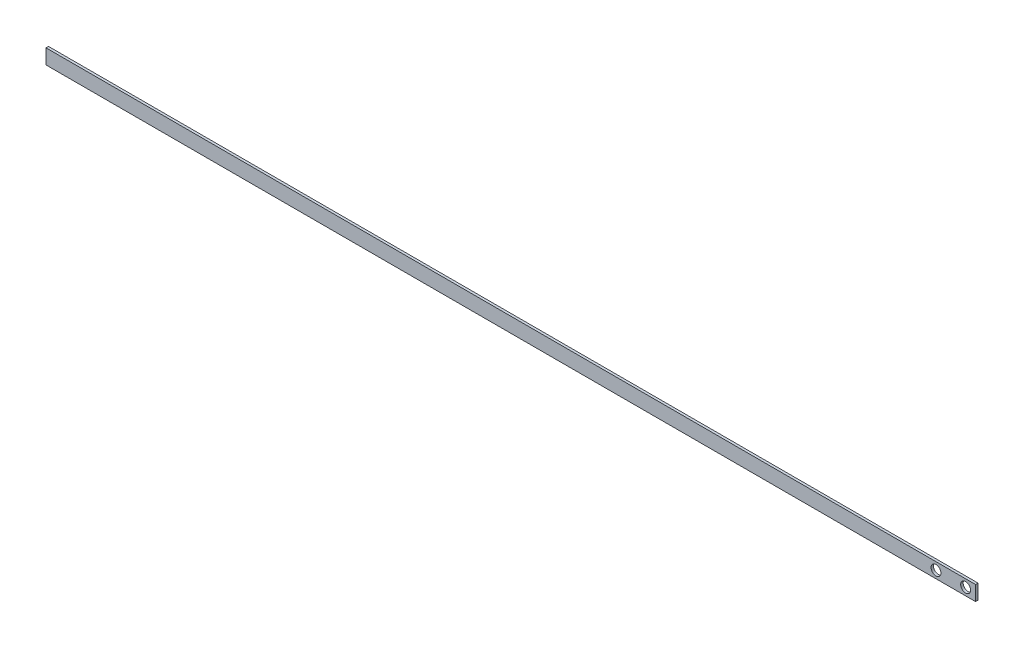
ISO-10303-21;
HEADER;
FILE_DESCRIPTION(('STEP AP214'),'2;1');
FILE_NAME('part.step','',(''),(''),'','','');
FILE_SCHEMA(('AUTOMOTIVE_DESIGN { 1 0 10303 214 1 1 1 1 }'));
ENDSEC;
DATA;
#1=APPLICATION_CONTEXT('core data for automotive mechanical design processes');
#2=APPLICATION_PROTOCOL_DEFINITION('international standard','automotive_design',2000,#1);
#3=PRODUCT_CONTEXT('',#1,'mechanical');
#4=PRODUCT('Part','Part','',(#3));
#5=PRODUCT_RELATED_PRODUCT_CATEGORY('part','',(#4));
#6=PRODUCT_DEFINITION_FORMATION('','',#4);
#7=PRODUCT_DEFINITION_CONTEXT('part definition',#1,'design');
#8=PRODUCT_DEFINITION('design','',#6,#7);
#9=PRODUCT_DEFINITION_SHAPE('','',#8);
#10=(LENGTH_UNIT() NAMED_UNIT(*) SI_UNIT(.MILLI.,.METRE.));
#11=(NAMED_UNIT(*) PLANE_ANGLE_UNIT() SI_UNIT($,.RADIAN.));
#12=(NAMED_UNIT(*) SI_UNIT($,.STERADIAN.) SOLID_ANGLE_UNIT());
#13=UNCERTAINTY_MEASURE_WITH_UNIT(LENGTH_MEASURE(1.E-05),#10,'distance_accuracy_value','');
#14=(GEOMETRIC_REPRESENTATION_CONTEXT(3) GLOBAL_UNCERTAINTY_ASSIGNED_CONTEXT((#13)) GLOBAL_UNIT_ASSIGNED_CONTEXT((#10,
#11,#12)) REPRESENTATION_CONTEXT('',''));
#15=CARTESIAN_POINT('',(0.,0.,0.));
#16=DIRECTION('',(0.,0.,1.));
#17=DIRECTION('',(1.,0.,0.));
#18=AXIS2_PLACEMENT_3D('',#15,#16,#17);
#19=CARTESIAN_POINT('',(0.,0.,0.5));
#20=DIRECTION('',(1.,0.,0.));
#21=DIRECTION('',(0.,1.,0.));
#22=AXIS2_PLACEMENT_3D('',#19,#20,#21);
#23=PLANE('',#22);
#24=DIRECTION('',(0.,-1.,0.));
#25=VECTOR('',#24,1.);
#26=CARTESIAN_POINT('',(0.,0.,0.));
#27=LINE('',#26,#25);
#28=CARTESIAN_POINT('',(0.,0.,0.));
#29=VERTEX_POINT('',#28);
#30=CARTESIAN_POINT('',(0.,-3.,0.));
#31=VERTEX_POINT('',#30);
#32=EDGE_CURVE('E101',#29,#31,#27,.T.);
#33=ORIENTED_EDGE('',*,*,#32,.T.);
#34=DIRECTION('',(0.,0.,-1.));
#35=VECTOR('',#34,1.);
#36=CARTESIAN_POINT('',(0.,-3.,0.5));
#37=LINE('',#36,#35);
#38=CARTESIAN_POINT('',(0.,-3.,0.5));
#39=VERTEX_POINT('',#38);
#40=EDGE_CURVE('E11',#39,#31,#37,.T.);
#41=ORIENTED_EDGE('',*,*,#40,.F.);
#42=DIRECTION('',(0.,-1.,0.));
#43=VECTOR('',#42,1.);
#44=CARTESIAN_POINT('',(0.,0.,0.5));
#45=LINE('',#44,#43);
#46=CARTESIAN_POINT('',(0.,0.,0.5));
#47=VERTEX_POINT('',#46);
#48=EDGE_CURVE('E88',#47,#39,#45,.T.);
#49=ORIENTED_EDGE('',*,*,#48,.F.);
#50=DIRECTION('',(0.,0.,-1.));
#51=VECTOR('',#50,1.);
#52=CARTESIAN_POINT('',(0.,0.,0.5));
#53=LINE('',#52,#51);
#54=EDGE_CURVE('E97',#47,#29,#53,.T.);
#55=ORIENTED_EDGE('',*,*,#54,.T.);
#56=EDGE_LOOP('',(#33,#41,#49,#55));
#57=FACE_BOUND('',#56,.T.);
#58=ADVANCED_FACE('F35',(#57),#23,.F.);
#59=CARTESIAN_POINT('',(0.,-3.,0.5));
#60=DIRECTION('',(0.,1.,0.));
#61=DIRECTION('',(0.,0.,1.));
#62=AXIS2_PLACEMENT_3D('',#59,#60,#61);
#63=PLANE('',#62);
#64=DIRECTION('',(1.,0.,0.));
#65=VECTOR('',#64,1.);
#66=CARTESIAN_POINT('',(0.,-3.,0.));
#67=LINE('',#66,#65);
#68=CARTESIAN_POINT('',(188.,-3.,0.));
#69=VERTEX_POINT('',#68);
#70=EDGE_CURVE('E92',#31,#69,#67,.T.);
#71=ORIENTED_EDGE('',*,*,#70,.T.);
#72=DIRECTION('',(0.,0.,-1.));
#73=VECTOR('',#72,1.);
#74=CARTESIAN_POINT('',(188.,-3.,0.5));
#75=LINE('',#74,#73);
#76=CARTESIAN_POINT('',(188.,-3.,0.5));
#77=VERTEX_POINT('',#76);
#78=EDGE_CURVE('E44',#77,#69,#75,.T.);
#79=ORIENTED_EDGE('',*,*,#78,.F.);
#80=DIRECTION('',(1.,0.,0.));
#81=VECTOR('',#80,1.);
#82=CARTESIAN_POINT('',(0.,-3.,0.5));
#83=LINE('',#82,#81);
#84=EDGE_CURVE('E83',#39,#77,#83,.T.);
#85=ORIENTED_EDGE('',*,*,#84,.F.);
#86=ORIENTED_EDGE('',*,*,#40,.T.);
#87=EDGE_LOOP('',(#71,#79,#85,#86));
#88=FACE_BOUND('',#87,.T.);
#89=ADVANCED_FACE('F91',(#88),#63,.F.);
#90=CARTESIAN_POINT('',(188.,0.,0.5));
#91=DIRECTION('',(-1.,0.,0.));
#92=DIRECTION('',(0.,0.,1.));
#93=AXIS2_PLACEMENT_3D('',#90,#91,#92);
#94=PLANE('',#93);
#95=DIRECTION('',(0.,1.,0.));
#96=VECTOR('',#95,1.);
#97=CARTESIAN_POINT('',(188.,0.,0.));
#98=LINE('',#97,#96);
#99=CARTESIAN_POINT('',(188.,0.,0.));
#100=VERTEX_POINT('',#99);
#101=EDGE_CURVE('E70',#69,#100,#98,.T.);
#102=ORIENTED_EDGE('',*,*,#101,.T.);
#103=DIRECTION('',(0.,0.,-1.));
#104=VECTOR('',#103,1.);
#105=CARTESIAN_POINT('',(188.,0.,0.5));
#106=LINE('',#105,#104);
#107=CARTESIAN_POINT('',(188.,0.,0.5));
#108=VERTEX_POINT('',#107);
#109=EDGE_CURVE('E93',#108,#100,#106,.T.);
#110=ORIENTED_EDGE('',*,*,#109,.F.);
#111=DIRECTION('',(0.,1.,0.));
#112=VECTOR('',#111,1.);
#113=CARTESIAN_POINT('',(188.,0.,0.5));
#114=LINE('',#113,#112);
#115=EDGE_CURVE('E86',#77,#108,#114,.T.);
#116=ORIENTED_EDGE('',*,*,#115,.F.);
#117=ORIENTED_EDGE('',*,*,#78,.T.);
#118=EDGE_LOOP('',(#102,#110,#116,#117));
#119=FACE_BOUND('',#118,.T.);
#120=ADVANCED_FACE('F95',(#119),#94,.F.);
#121=CARTESIAN_POINT('',(0.,0.,0.5));
#122=DIRECTION('',(0.,-1.,0.));
#123=DIRECTION('',(0.,0.,-1.));
#124=AXIS2_PLACEMENT_3D('',#121,#122,#123);
#125=PLANE('',#124);
#126=DIRECTION('',(-1.,0.,0.));
#127=VECTOR('',#126,1.);
#128=CARTESIAN_POINT('',(0.,0.,0.));
#129=LINE('',#128,#127);
#130=EDGE_CURVE('E76',#100,#29,#129,.T.);
#131=ORIENTED_EDGE('',*,*,#130,.T.);
#132=ORIENTED_EDGE('',*,*,#54,.F.);
#133=DIRECTION('',(-1.,0.,0.));
#134=VECTOR('',#133,1.);
#135=CARTESIAN_POINT('',(0.,0.,0.5));
#136=LINE('',#135,#134);
#137=EDGE_CURVE('E53',#108,#47,#136,.T.);
#138=ORIENTED_EDGE('',*,*,#137,.F.);
#139=ORIENTED_EDGE('',*,*,#109,.T.);
#140=EDGE_LOOP('',(#131,#132,#138,#139));
#141=FACE_BOUND('',#140,.T.);
#142=ADVANCED_FACE('F129',(#141),#125,.F.);
#143=CARTESIAN_POINT('',(0.,-3.,0.5));
#144=DIRECTION('',(0.,0.,1.));
#145=DIRECTION('',(1.,0.,0.));
#146=AXIS2_PLACEMENT_3D('',#143,#144,#145);
#147=PLANE('',#146);
#148=CARTESIAN_POINT('',(186.,-1.5,0.5));
#149=DIRECTION('',(0.,0.,1.));
#150=DIRECTION('',(1.,0.,0.));
#151=AXIS2_PLACEMENT_3D('',#148,#149,#150);
#152=CIRCLE('',#151,0.999999999999998);
#153=CARTESIAN_POINT('',(187.,-1.5,0.5));
#154=VERTEX_POINT('',#153);
#155=EDGE_CURVE('E118',#154,#154,#152,.T.);
#156=ORIENTED_EDGE('',*,*,#155,.F.);
#157=EDGE_LOOP('',(#156));
#158=FACE_BOUND('',#157,.T.);
#159=CARTESIAN_POINT('',(180.,-1.5,0.5));
#160=DIRECTION('',(0.,0.,1.));
#161=DIRECTION('',(1.,0.,0.));
#162=AXIS2_PLACEMENT_3D('',#159,#160,#161);
#163=CIRCLE('',#162,0.999999999999998);
#164=CARTESIAN_POINT('',(181.,-1.5,0.5));
#165=VERTEX_POINT('',#164);
#166=EDGE_CURVE('E110',#165,#165,#163,.T.);
#167=ORIENTED_EDGE('',*,*,#166,.F.);
#168=EDGE_LOOP('',(#167));
#169=FACE_BOUND('',#168,.T.);
#170=ORIENTED_EDGE('',*,*,#48,.T.);
#171=ORIENTED_EDGE('',*,*,#84,.T.);
#172=ORIENTED_EDGE('',*,*,#115,.T.);
#173=ORIENTED_EDGE('',*,*,#137,.T.);
#174=EDGE_LOOP('',(#170,#171,#172,#173));
#175=FACE_BOUND('',#174,.T.);
#176=ADVANCED_FACE('F84',(#158,#169,#175),#147,.T.);
#177=CARTESIAN_POINT('',(0.,-3.,0.));
#178=DIRECTION('',(0.,0.,1.));
#179=DIRECTION('',(1.,0.,0.));
#180=AXIS2_PLACEMENT_3D('',#177,#178,#179);
#181=PLANE('',#180);
#182=CARTESIAN_POINT('',(186.,-1.5,0.));
#183=DIRECTION('',(0.,0.,1.));
#184=DIRECTION('',(1.,0.,0.));
#185=AXIS2_PLACEMENT_3D('',#182,#183,#184);
#186=CIRCLE('',#185,0.999999999999998);
#187=CARTESIAN_POINT('',(187.,-1.5,0.));
#188=VERTEX_POINT('',#187);
#189=EDGE_CURVE('E38',#188,#188,#186,.T.);
#190=ORIENTED_EDGE('',*,*,#189,.T.);
#191=EDGE_LOOP('',(#190));
#192=FACE_BOUND('',#191,.T.);
#193=CARTESIAN_POINT('',(180.,-1.5,0.));
#194=DIRECTION('',(0.,0.,1.));
#195=DIRECTION('',(1.,0.,0.));
#196=AXIS2_PLACEMENT_3D('',#193,#194,#195);
#197=CIRCLE('',#196,0.999999999999998);
#198=CARTESIAN_POINT('',(181.,-1.5,0.));
#199=VERTEX_POINT('',#198);
#200=EDGE_CURVE('E104',#199,#199,#197,.T.);
#201=ORIENTED_EDGE('',*,*,#200,.T.);
#202=EDGE_LOOP('',(#201));
#203=FACE_BOUND('',#202,.T.);
#204=ORIENTED_EDGE('',*,*,#32,.F.);
#205=ORIENTED_EDGE('',*,*,#130,.F.);
#206=ORIENTED_EDGE('',*,*,#101,.F.);
#207=ORIENTED_EDGE('',*,*,#70,.F.);
#208=EDGE_LOOP('',(#204,#205,#206,#207));
#209=FACE_BOUND('',#208,.T.);
#210=ADVANCED_FACE('F128',(#192,#203,#209),#181,.F.);
#211=CARTESIAN_POINT('',(180.,-1.5,-0.5));
#212=DIRECTION('',(0.,0.,1.));
#213=DIRECTION('',(1.,0.,0.));
#214=AXIS2_PLACEMENT_3D('',#211,#212,#213);
#215=CYLINDRICAL_SURFACE('',#214,0.999999999999998);
#216=ORIENTED_EDGE('',*,*,#166,.T.);
#217=EDGE_LOOP('',(#216));
#218=FACE_BOUND('',#217,.T.);
#219=ORIENTED_EDGE('',*,*,#200,.F.);
#220=EDGE_LOOP('',(#219));
#221=FACE_BOUND('',#220,.T.);
#222=ADVANCED_FACE('F135',(#218,#221),#215,.F.);
#223=CARTESIAN_POINT('',(186.,-1.5,-0.5));
#224=DIRECTION('',(0.,0.,1.));
#225=DIRECTION('',(1.,0.,0.));
#226=AXIS2_PLACEMENT_3D('',#223,#224,#225);
#227=CYLINDRICAL_SURFACE('',#226,0.999999999999998);
#228=ORIENTED_EDGE('',*,*,#155,.T.);
#229=EDGE_LOOP('',(#228));
#230=FACE_BOUND('',#229,.T.);
#231=ORIENTED_EDGE('',*,*,#189,.F.);
#232=EDGE_LOOP('',(#231));
#233=FACE_BOUND('',#232,.T.);
#234=ADVANCED_FACE('F123',(#230,#233),#227,.F.);
#235=CLOSED_SHELL('',(#58,#89,#120,#142,#176,#210,#222,#234));
#236=MANIFOLD_SOLID_BREP('B2',#235);
#237=ADVANCED_BREP_SHAPE_REPRESENTATION('',(#18,#236),#14);
#238=SHAPE_DEFINITION_REPRESENTATION(#9,#237);
ENDSEC;
END-ISO-10303-21;
